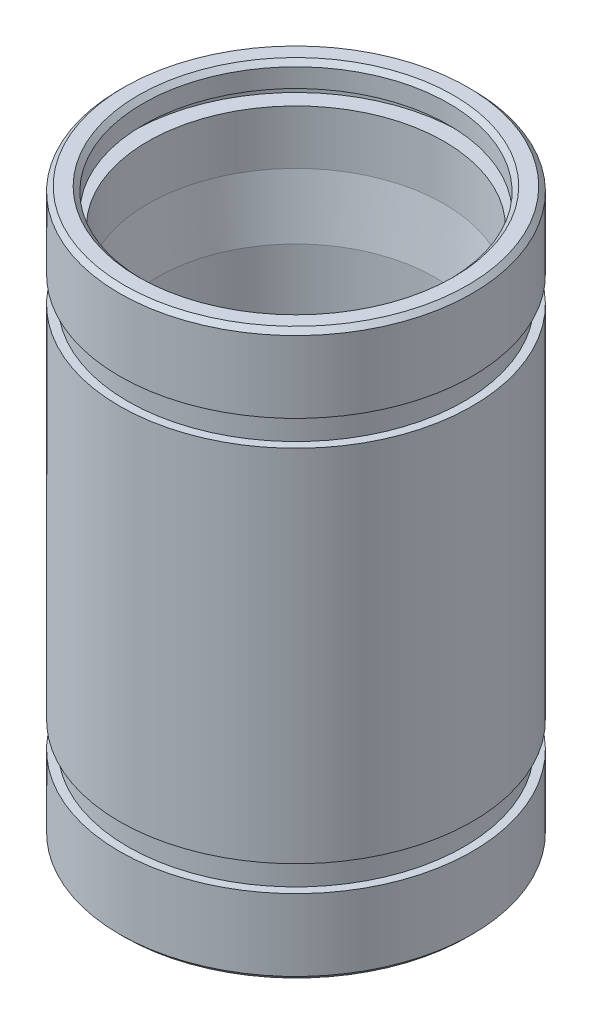
ISO-10303-21;
HEADER;
FILE_DESCRIPTION(('STEP AP214'),'2;1');
FILE_NAME('part.step','',(''),(''),'','','');
FILE_SCHEMA(('AUTOMOTIVE_DESIGN { 1 0 10303 214 1 1 1 1 }'));
ENDSEC;
DATA;
#1=APPLICATION_CONTEXT('core data for automotive mechanical design processes');
#2=APPLICATION_PROTOCOL_DEFINITION('international standard','automotive_design',2000,#1);
#3=PRODUCT_CONTEXT('',#1,'mechanical');
#4=PRODUCT('Part','Part','',(#3));
#5=PRODUCT_RELATED_PRODUCT_CATEGORY('part','',(#4));
#6=PRODUCT_DEFINITION_FORMATION('','',#4);
#7=PRODUCT_DEFINITION_CONTEXT('part definition',#1,'design');
#8=PRODUCT_DEFINITION('design','',#6,#7);
#9=PRODUCT_DEFINITION_SHAPE('','',#8);
#10=(LENGTH_UNIT() NAMED_UNIT(*) SI_UNIT(.MILLI.,.METRE.));
#11=(NAMED_UNIT(*) PLANE_ANGLE_UNIT() SI_UNIT($,.RADIAN.));
#12=(NAMED_UNIT(*) SI_UNIT($,.STERADIAN.) SOLID_ANGLE_UNIT());
#13=UNCERTAINTY_MEASURE_WITH_UNIT(LENGTH_MEASURE(1.E-05),#10,'distance_accuracy_value','');
#14=(GEOMETRIC_REPRESENTATION_CONTEXT(3) GLOBAL_UNCERTAINTY_ASSIGNED_CONTEXT((#13)) GLOBAL_UNIT_ASSIGNED_CONTEXT((#10,
#11,#12)) REPRESENTATION_CONTEXT('',''));
#15=CARTESIAN_POINT('',(0.,0.,0.));
#16=DIRECTION('',(0.,0.,1.));
#17=DIRECTION('',(1.,0.,0.));
#18=AXIS2_PLACEMENT_3D('',#15,#16,#17);
#19=CARTESIAN_POINT('',(0.,10.5,-7.));
#20=DIRECTION('',(0.,-1.,0.));
#21=DIRECTION('',(0.,0.,-1.));
#22=AXIS2_PLACEMENT_3D('',#19,#20,#21);
#23=PLANE('',#22);
#24=CARTESIAN_POINT('',(0.,10.5,0.));
#25=DIRECTION('',(0.,1.,0.));
#26=DIRECTION('',(0.,0.,1.));
#27=AXIS2_PLACEMENT_3D('',#24,#25,#26);
#28=CIRCLE('',#27,6.3);
#29=CARTESIAN_POINT('',(0.,10.5,6.30000000000001));
#30=VERTEX_POINT('',#29);
#31=EDGE_CURVE('E10',#30,#30,#28,.T.);
#32=ORIENTED_EDGE('',*,*,#31,.F.);
#33=EDGE_LOOP('',(#32));
#34=FACE_BOUND('',#33,.T.);
#35=CARTESIAN_POINT('',(0.,10.5,0.));
#36=DIRECTION('',(0.,1.,0.));
#37=DIRECTION('',(0.,0.,1.));
#38=AXIS2_PLACEMENT_3D('',#35,#36,#37);
#39=CIRCLE('',#38,7.);
#40=CARTESIAN_POINT('',(0.,10.5,7.00000000000001));
#41=VERTEX_POINT('',#40);
#42=EDGE_CURVE('E122',#41,#41,#39,.T.);
#43=ORIENTED_EDGE('',*,*,#42,.T.);
#44=EDGE_LOOP('',(#43));
#45=FACE_BOUND('',#44,.T.);
#46=ADVANCED_FACE('F34',(#34,#45),#23,.F.);
#47=CARTESIAN_POINT('',(0.,12.,0.));
#48=DIRECTION('',(0.,1.,0.));
#49=DIRECTION('',(0.,0.,1.));
#50=AXIS2_PLACEMENT_3D('',#47,#48,#49);
#51=CYLINDRICAL_SURFACE('',#50,6.3);
#52=CARTESIAN_POINT('',(0.,8.2,0.));
#53=DIRECTION('',(0.,1.,0.));
#54=DIRECTION('',(0.,0.,1.));
#55=AXIS2_PLACEMENT_3D('',#52,#53,#54);
#56=CIRCLE('',#55,6.3);
#57=CARTESIAN_POINT('',(0.,8.2,6.30000000000001));
#58=VERTEX_POINT('',#57);
#59=EDGE_CURVE('E40',#58,#58,#56,.T.);
#60=ORIENTED_EDGE('',*,*,#59,.F.);
#61=EDGE_LOOP('',(#60));
#62=FACE_BOUND('',#61,.T.);
#63=ORIENTED_EDGE('',*,*,#31,.T.);
#64=EDGE_LOOP('',(#63));
#65=FACE_BOUND('',#64,.T.);
#66=ADVANCED_FACE('F279',(#62,#65),#51,.F.);
#67=CARTESIAN_POINT('',(0.,8.2,0.));
#68=DIRECTION('',(0.,1.,0.));
#69=DIRECTION('',(0.,0.,1.));
#70=AXIS2_PLACEMENT_3D('',#67,#68,#69);
#71=CONICAL_SURFACE('',#70,6.3,0.158655262186401);
#72=CARTESIAN_POINT('',(0.,5.7,0.));
#73=DIRECTION('',(0.,1.,0.));
#74=DIRECTION('',(0.,0.,1.));
#75=AXIS2_PLACEMENT_3D('',#72,#73,#74);
#76=CIRCLE('',#75,5.9);
#77=CARTESIAN_POINT('',(0.,5.7,5.90000000000001));
#78=VERTEX_POINT('',#77);
#79=EDGE_CURVE('E44',#78,#78,#76,.T.);
#80=ORIENTED_EDGE('',*,*,#79,.F.);
#81=EDGE_LOOP('',(#80));
#82=FACE_BOUND('',#81,.T.);
#83=ORIENTED_EDGE('',*,*,#59,.T.);
#84=EDGE_LOOP('',(#83));
#85=FACE_BOUND('',#84,.T.);
#86=ADVANCED_FACE('F274',(#82,#85),#71,.F.);
#87=CARTESIAN_POINT('',(0.,12.,0.));
#88=DIRECTION('',(0.,1.,0.));
#89=DIRECTION('',(0.,0.,1.));
#90=AXIS2_PLACEMENT_3D('',#87,#88,#89);
#91=CYLINDRICAL_SURFACE('',#90,5.9);
#92=CARTESIAN_POINT('',(0.,-5.7,0.));
#93=DIRECTION('',(0.,1.,0.));
#94=DIRECTION('',(0.,0.,1.));
#95=AXIS2_PLACEMENT_3D('',#92,#93,#94);
#96=CIRCLE('',#95,5.9);
#97=CARTESIAN_POINT('',(0.,-5.70000000000001,5.9));
#98=VERTEX_POINT('',#97);
#99=EDGE_CURVE('E48',#98,#98,#96,.T.);
#100=ORIENTED_EDGE('',*,*,#99,.F.);
#101=EDGE_LOOP('',(#100));
#102=FACE_BOUND('',#101,.T.);
#103=ORIENTED_EDGE('',*,*,#79,.T.);
#104=EDGE_LOOP('',(#103));
#105=FACE_BOUND('',#104,.T.);
#106=ADVANCED_FACE('F268',(#102,#105),#91,.F.);
#107=CARTESIAN_POINT('',(0.,-5.7,0.));
#108=DIRECTION('',(0.,-1.,0.));
#109=DIRECTION('',(0.,0.,-1.));
#110=AXIS2_PLACEMENT_3D('',#107,#108,#109);
#111=CONICAL_SURFACE('',#110,5.9,0.158655262186401);
#112=CARTESIAN_POINT('',(0.,-8.20000000000001,0.));
#113=DIRECTION('',(0.,1.,0.));
#114=DIRECTION('',(0.,0.,1.));
#115=AXIS2_PLACEMENT_3D('',#112,#113,#114);
#116=CIRCLE('',#115,6.3);
#117=CARTESIAN_POINT('',(0.,-8.20000000000001,6.3));
#118=VERTEX_POINT('',#117);
#119=EDGE_CURVE('E53',#118,#118,#116,.T.);
#120=ORIENTED_EDGE('',*,*,#119,.F.);
#121=EDGE_LOOP('',(#120));
#122=FACE_BOUND('',#121,.T.);
#123=ORIENTED_EDGE('',*,*,#99,.T.);
#124=EDGE_LOOP('',(#123));
#125=FACE_BOUND('',#124,.T.);
#126=ADVANCED_FACE('F262',(#122,#125),#111,.F.);
#127=CARTESIAN_POINT('',(0.,12.,0.));
#128=DIRECTION('',(0.,1.,0.));
#129=DIRECTION('',(0.,0.,1.));
#130=AXIS2_PLACEMENT_3D('',#127,#128,#129);
#131=CYLINDRICAL_SURFACE('',#130,6.3);
#132=CARTESIAN_POINT('',(0.,-10.5,0.));
#133=DIRECTION('',(0.,1.,0.));
#134=DIRECTION('',(0.,0.,1.));
#135=AXIS2_PLACEMENT_3D('',#132,#133,#134);
#136=CIRCLE('',#135,6.3);
#137=CARTESIAN_POINT('',(0.,-10.5,6.29999999999999));
#138=VERTEX_POINT('',#137);
#139=EDGE_CURVE('E56',#138,#138,#136,.T.);
#140=ORIENTED_EDGE('',*,*,#139,.F.);
#141=EDGE_LOOP('',(#140));
#142=FACE_BOUND('',#141,.T.);
#143=ORIENTED_EDGE('',*,*,#119,.T.);
#144=EDGE_LOOP('',(#143));
#145=FACE_BOUND('',#144,.T.);
#146=ADVANCED_FACE('F256',(#142,#145),#131,.F.);
#147=CARTESIAN_POINT('',(0.,-10.5,-7.));
#148=DIRECTION('',(0.,1.,0.));
#149=DIRECTION('',(0.,0.,1.));
#150=AXIS2_PLACEMENT_3D('',#147,#148,#149);
#151=PLANE('',#150);
#152=CARTESIAN_POINT('',(0.,-10.5,0.));
#153=DIRECTION('',(0.,1.,0.));
#154=DIRECTION('',(0.,0.,1.));
#155=AXIS2_PLACEMENT_3D('',#152,#153,#154);
#156=CIRCLE('',#155,7.);
#157=CARTESIAN_POINT('',(0.,-10.5,6.99999999999999));
#158=VERTEX_POINT('',#157);
#159=EDGE_CURVE('E59',#158,#158,#156,.T.);
#160=ORIENTED_EDGE('',*,*,#159,.F.);
#161=EDGE_LOOP('',(#160));
#162=FACE_BOUND('',#161,.T.);
#163=ORIENTED_EDGE('',*,*,#139,.T.);
#164=EDGE_LOOP('',(#163));
#165=FACE_BOUND('',#164,.T.);
#166=ADVANCED_FACE('F250',(#162,#165),#151,.F.);
#167=CARTESIAN_POINT('',(0.,12.,0.));
#168=DIRECTION('',(0.,1.,0.));
#169=DIRECTION('',(0.,0.,1.));
#170=AXIS2_PLACEMENT_3D('',#167,#168,#169);
#171=CYLINDRICAL_SURFACE('',#170,7.);
#172=CARTESIAN_POINT('',(0.,-11.,0.));
#173=DIRECTION('',(0.,1.,0.));
#174=DIRECTION('',(0.,0.,1.));
#175=AXIS2_PLACEMENT_3D('',#172,#173,#174);
#176=CIRCLE('',#175,7.);
#177=CARTESIAN_POINT('',(0.,-11.,6.99999999999999));
#178=VERTEX_POINT('',#177);
#179=EDGE_CURVE('E62',#178,#178,#176,.T.);
#180=ORIENTED_EDGE('',*,*,#179,.F.);
#181=EDGE_LOOP('',(#180));
#182=FACE_BOUND('',#181,.T.);
#183=ORIENTED_EDGE('',*,*,#159,.T.);
#184=EDGE_LOOP('',(#183));
#185=FACE_BOUND('',#184,.T.);
#186=ADVANCED_FACE('F244',(#182,#185),#171,.F.);
#187=CARTESIAN_POINT('',(0.,-11.,-6.5));
#188=DIRECTION('',(0.,-1.,0.));
#189=DIRECTION('',(0.,0.,-1.));
#190=AXIS2_PLACEMENT_3D('',#187,#188,#189);
#191=PLANE('',#190);
#192=CARTESIAN_POINT('',(0.,-11.,0.));
#193=DIRECTION('',(0.,1.,0.));
#194=DIRECTION('',(0.,0.,1.));
#195=AXIS2_PLACEMENT_3D('',#192,#193,#194);
#196=CIRCLE('',#195,6.49999999999999);
#197=CARTESIAN_POINT('',(0.,-11.,6.49999999999999));
#198=VERTEX_POINT('',#197);
#199=EDGE_CURVE('E65',#198,#198,#196,.T.);
#200=ORIENTED_EDGE('',*,*,#199,.F.);
#201=EDGE_LOOP('',(#200));
#202=FACE_BOUND('',#201,.T.);
#203=ORIENTED_EDGE('',*,*,#179,.T.);
#204=EDGE_LOOP('',(#203));
#205=FACE_BOUND('',#204,.T.);
#206=ADVANCED_FACE('F238',(#202,#205),#191,.F.);
#207=CARTESIAN_POINT('',(0.,12.,0.));
#208=DIRECTION('',(0.,1.,0.));
#209=DIRECTION('',(0.,0.,1.));
#210=AXIS2_PLACEMENT_3D('',#207,#208,#209);
#211=CYLINDRICAL_SURFACE('',#210,6.49999999999999);
#212=CARTESIAN_POINT('',(0.,-11.8,0.));
#213=DIRECTION('',(0.,1.,0.));
#214=DIRECTION('',(0.,0.,1.));
#215=AXIS2_PLACEMENT_3D('',#212,#213,#214);
#216=CIRCLE('',#215,6.49999999999999);
#217=CARTESIAN_POINT('',(0.,-11.8,6.49999999999999));
#218=VERTEX_POINT('',#217);
#219=EDGE_CURVE('E68',#218,#218,#216,.T.);
#220=ORIENTED_EDGE('',*,*,#219,.F.);
#221=EDGE_LOOP('',(#220));
#222=FACE_BOUND('',#221,.T.);
#223=ORIENTED_EDGE('',*,*,#199,.T.);
#224=EDGE_LOOP('',(#223));
#225=FACE_BOUND('',#224,.T.);
#226=ADVANCED_FACE('F232',(#222,#225),#211,.F.);
#227=CARTESIAN_POINT('',(0.,-11.8,0.));
#228=DIRECTION('',(0.,-1.,0.));
#229=DIRECTION('',(0.,0.,-1.));
#230=AXIS2_PLACEMENT_3D('',#227,#228,#229);
#231=CONICAL_SURFACE('',#230,6.49999999999999,0.785398163397444);
#232=CARTESIAN_POINT('',(0.,-12.,0.));
#233=DIRECTION('',(0.,1.,0.));
#234=DIRECTION('',(0.,0.,1.));
#235=AXIS2_PLACEMENT_3D('',#232,#233,#234);
#236=CIRCLE('',#235,6.69999999999999);
#237=CARTESIAN_POINT('',(0.,-12.,6.69999999999999));
#238=VERTEX_POINT('',#237);
#239=EDGE_CURVE('E71',#238,#238,#236,.T.);
#240=ORIENTED_EDGE('',*,*,#239,.F.);
#241=EDGE_LOOP('',(#240));
#242=FACE_BOUND('',#241,.T.);
#243=ORIENTED_EDGE('',*,*,#219,.T.);
#244=EDGE_LOOP('',(#243));
#245=FACE_BOUND('',#244,.T.);
#246=ADVANCED_FACE('F226',(#242,#245),#231,.F.);
#247=CARTESIAN_POINT('',(0.,-12.,-6.7));
#248=DIRECTION('',(0.,1.,0.));
#249=DIRECTION('',(0.,0.,1.));
#250=AXIS2_PLACEMENT_3D('',#247,#248,#249);
#251=PLANE('',#250);
#252=CARTESIAN_POINT('',(0.,-12.,0.));
#253=DIRECTION('',(0.,1.,0.));
#254=DIRECTION('',(0.,0.,1.));
#255=AXIS2_PLACEMENT_3D('',#252,#253,#254);
#256=CIRCLE('',#255,7.29999999999999);
#257=CARTESIAN_POINT('',(0.,-12.,7.29999999999999));
#258=VERTEX_POINT('',#257);
#259=EDGE_CURVE('E74',#258,#258,#256,.T.);
#260=ORIENTED_EDGE('',*,*,#259,.F.);
#261=EDGE_LOOP('',(#260));
#262=FACE_BOUND('',#261,.T.);
#263=ORIENTED_EDGE('',*,*,#239,.T.);
#264=EDGE_LOOP('',(#263));
#265=FACE_BOUND('',#264,.T.);
#266=ADVANCED_FACE('F220',(#262,#265),#251,.F.);
#267=CARTESIAN_POINT('',(0.,-12.,0.));
#268=DIRECTION('',(0.,1.,0.));
#269=DIRECTION('',(0.,0.,1.));
#270=AXIS2_PLACEMENT_3D('',#267,#268,#269);
#271=CONICAL_SURFACE('',#270,7.29999999999999,0.785398163397455);
#272=CARTESIAN_POINT('',(0.,-11.8,0.));
#273=DIRECTION('',(0.,1.,0.));
#274=DIRECTION('',(0.,0.,1.));
#275=AXIS2_PLACEMENT_3D('',#272,#273,#274);
#276=CIRCLE('',#275,7.49999999999999);
#277=CARTESIAN_POINT('',(0.,-11.8,7.49999999999999));
#278=VERTEX_POINT('',#277);
#279=EDGE_CURVE('E77',#278,#278,#276,.T.);
#280=ORIENTED_EDGE('',*,*,#279,.F.);
#281=EDGE_LOOP('',(#280));
#282=FACE_BOUND('',#281,.T.);
#283=ORIENTED_EDGE('',*,*,#259,.T.);
#284=EDGE_LOOP('',(#283));
#285=FACE_BOUND('',#284,.T.);
#286=ADVANCED_FACE('F214',(#282,#285),#271,.T.);
#287=CARTESIAN_POINT('',(0.,12.,0.));
#288=DIRECTION('',(0.,1.,0.));
#289=DIRECTION('',(0.,0.,1.));
#290=AXIS2_PLACEMENT_3D('',#287,#288,#289);
#291=CYLINDRICAL_SURFACE('',#290,7.49999999999999);
#292=CARTESIAN_POINT('',(0.,-8.75,0.));
#293=DIRECTION('',(0.,1.,0.));
#294=DIRECTION('',(0.,0.,1.));
#295=AXIS2_PLACEMENT_3D('',#292,#293,#294);
#296=CIRCLE('',#295,7.5);
#297=CARTESIAN_POINT('',(0.,-8.75000000000001,7.49999999999999));
#298=VERTEX_POINT('',#297);
#299=EDGE_CURVE('E80',#298,#298,#296,.T.);
#300=ORIENTED_EDGE('',*,*,#299,.F.);
#301=EDGE_LOOP('',(#300));
#302=FACE_BOUND('',#301,.T.);
#303=ORIENTED_EDGE('',*,*,#279,.T.);
#304=EDGE_LOOP('',(#303));
#305=FACE_BOUND('',#304,.T.);
#306=ADVANCED_FACE('F208',(#302,#305),#291,.T.);
#307=CARTESIAN_POINT('',(0.,-8.75,-7.5));
#308=DIRECTION('',(0.,-1.,0.));
#309=DIRECTION('',(0.,0.,-1.));
#310=AXIS2_PLACEMENT_3D('',#307,#308,#309);
#311=PLANE('',#310);
#312=CARTESIAN_POINT('',(0.,-8.75,0.));
#313=DIRECTION('',(0.,1.,0.));
#314=DIRECTION('',(0.,0.,1.));
#315=AXIS2_PLACEMENT_3D('',#312,#313,#314);
#316=CIRCLE('',#315,7.15);
#317=CARTESIAN_POINT('',(0.,-8.75000000000001,7.15));
#318=VERTEX_POINT('',#317);
#319=EDGE_CURVE('E83',#318,#318,#316,.T.);
#320=ORIENTED_EDGE('',*,*,#319,.F.);
#321=EDGE_LOOP('',(#320));
#322=FACE_BOUND('',#321,.T.);
#323=ORIENTED_EDGE('',*,*,#299,.T.);
#324=EDGE_LOOP('',(#323));
#325=FACE_BOUND('',#324,.T.);
#326=ADVANCED_FACE('F202',(#322,#325),#311,.F.);
#327=CARTESIAN_POINT('',(0.,12.,0.));
#328=DIRECTION('',(0.,1.,0.));
#329=DIRECTION('',(0.,0.,1.));
#330=AXIS2_PLACEMENT_3D('',#327,#328,#329);
#331=CYLINDRICAL_SURFACE('',#330,7.15);
#332=CARTESIAN_POINT('',(0.,-7.65,0.));
#333=DIRECTION('',(0.,1.,0.));
#334=DIRECTION('',(0.,0.,1.));
#335=AXIS2_PLACEMENT_3D('',#332,#333,#334);
#336=CIRCLE('',#335,7.15);
#337=CARTESIAN_POINT('',(0.,-7.65000000000001,7.15));
#338=VERTEX_POINT('',#337);
#339=EDGE_CURVE('E86',#338,#338,#336,.T.);
#340=ORIENTED_EDGE('',*,*,#339,.F.);
#341=EDGE_LOOP('',(#340));
#342=FACE_BOUND('',#341,.T.);
#343=ORIENTED_EDGE('',*,*,#319,.T.);
#344=EDGE_LOOP('',(#343));
#345=FACE_BOUND('',#344,.T.);
#346=ADVANCED_FACE('F196',(#342,#345),#331,.T.);
#347=CARTESIAN_POINT('',(0.,-7.65,-7.15));
#348=DIRECTION('',(0.,1.,0.));
#349=DIRECTION('',(0.,0.,1.));
#350=AXIS2_PLACEMENT_3D('',#347,#348,#349);
#351=PLANE('',#350);
#352=CARTESIAN_POINT('',(0.,-7.65,0.));
#353=DIRECTION('',(0.,1.,0.));
#354=DIRECTION('',(0.,0.,1.));
#355=AXIS2_PLACEMENT_3D('',#352,#353,#354);
#356=CIRCLE('',#355,7.5);
#357=CARTESIAN_POINT('',(0.,-7.65000000000001,7.5));
#358=VERTEX_POINT('',#357);
#359=EDGE_CURVE('E89',#358,#358,#356,.T.);
#360=ORIENTED_EDGE('',*,*,#359,.F.);
#361=EDGE_LOOP('',(#360));
#362=FACE_BOUND('',#361,.T.);
#363=ORIENTED_EDGE('',*,*,#339,.T.);
#364=EDGE_LOOP('',(#363));
#365=FACE_BOUND('',#364,.T.);
#366=ADVANCED_FACE('F190',(#362,#365),#351,.F.);
#367=CARTESIAN_POINT('',(0.,12.,0.));
#368=DIRECTION('',(0.,1.,0.));
#369=DIRECTION('',(0.,0.,1.));
#370=AXIS2_PLACEMENT_3D('',#367,#368,#369);
#371=CYLINDRICAL_SURFACE('',#370,7.5);
#372=CARTESIAN_POINT('',(0.,7.65,0.));
#373=DIRECTION('',(0.,1.,0.));
#374=DIRECTION('',(0.,0.,1.));
#375=AXIS2_PLACEMENT_3D('',#372,#373,#374);
#376=CIRCLE('',#375,7.5);
#377=CARTESIAN_POINT('',(0.,7.65,7.50000000000001));
#378=VERTEX_POINT('',#377);
#379=EDGE_CURVE('E92',#378,#378,#376,.T.);
#380=ORIENTED_EDGE('',*,*,#379,.F.);
#381=EDGE_LOOP('',(#380));
#382=FACE_BOUND('',#381,.T.);
#383=ORIENTED_EDGE('',*,*,#359,.T.);
#384=EDGE_LOOP('',(#383));
#385=FACE_BOUND('',#384,.T.);
#386=ADVANCED_FACE('F184',(#382,#385),#371,.T.);
#387=CARTESIAN_POINT('',(0.,7.65,-7.15));
#388=DIRECTION('',(0.,-1.,0.));
#389=DIRECTION('',(0.,0.,-1.));
#390=AXIS2_PLACEMENT_3D('',#387,#388,#389);
#391=PLANE('',#390);
#392=CARTESIAN_POINT('',(0.,7.65,0.));
#393=DIRECTION('',(0.,1.,0.));
#394=DIRECTION('',(0.,0.,1.));
#395=AXIS2_PLACEMENT_3D('',#392,#393,#394);
#396=CIRCLE('',#395,7.15);
#397=CARTESIAN_POINT('',(0.,7.65,7.15000000000001));
#398=VERTEX_POINT('',#397);
#399=EDGE_CURVE('E95',#398,#398,#396,.T.);
#400=ORIENTED_EDGE('',*,*,#399,.F.);
#401=EDGE_LOOP('',(#400));
#402=FACE_BOUND('',#401,.T.);
#403=ORIENTED_EDGE('',*,*,#379,.T.);
#404=EDGE_LOOP('',(#403));
#405=FACE_BOUND('',#404,.T.);
#406=ADVANCED_FACE('F178',(#402,#405),#391,.F.);
#407=CARTESIAN_POINT('',(0.,12.,0.));
#408=DIRECTION('',(0.,1.,0.));
#409=DIRECTION('',(0.,0.,1.));
#410=AXIS2_PLACEMENT_3D('',#407,#408,#409);
#411=CYLINDRICAL_SURFACE('',#410,7.15);
#412=CARTESIAN_POINT('',(0.,8.75,0.));
#413=DIRECTION('',(0.,1.,0.));
#414=DIRECTION('',(0.,0.,1.));
#415=AXIS2_PLACEMENT_3D('',#412,#413,#414);
#416=CIRCLE('',#415,7.15);
#417=CARTESIAN_POINT('',(0.,8.75,7.15000000000001));
#418=VERTEX_POINT('',#417);
#419=EDGE_CURVE('E98',#418,#418,#416,.T.);
#420=ORIENTED_EDGE('',*,*,#419,.F.);
#421=EDGE_LOOP('',(#420));
#422=FACE_BOUND('',#421,.T.);
#423=ORIENTED_EDGE('',*,*,#399,.T.);
#424=EDGE_LOOP('',(#423));
#425=FACE_BOUND('',#424,.T.);
#426=ADVANCED_FACE('F172',(#422,#425),#411,.T.);
#427=CARTESIAN_POINT('',(0.,8.75,-7.5));
#428=DIRECTION('',(0.,1.,0.));
#429=DIRECTION('',(0.,0.,1.));
#430=AXIS2_PLACEMENT_3D('',#427,#428,#429);
#431=PLANE('',#430);
#432=CARTESIAN_POINT('',(0.,8.75,0.));
#433=DIRECTION('',(0.,1.,0.));
#434=DIRECTION('',(0.,0.,1.));
#435=AXIS2_PLACEMENT_3D('',#432,#433,#434);
#436=CIRCLE('',#435,7.5);
#437=CARTESIAN_POINT('',(0.,8.75,7.50000000000001));
#438=VERTEX_POINT('',#437);
#439=EDGE_CURVE('E101',#438,#438,#436,.T.);
#440=ORIENTED_EDGE('',*,*,#439,.F.);
#441=EDGE_LOOP('',(#440));
#442=FACE_BOUND('',#441,.T.);
#443=ORIENTED_EDGE('',*,*,#419,.T.);
#444=EDGE_LOOP('',(#443));
#445=FACE_BOUND('',#444,.T.);
#446=ADVANCED_FACE('F166',(#442,#445),#431,.F.);
#447=CARTESIAN_POINT('',(0.,12.,0.));
#448=DIRECTION('',(0.,1.,0.));
#449=DIRECTION('',(0.,0.,1.));
#450=AXIS2_PLACEMENT_3D('',#447,#448,#449);
#451=CYLINDRICAL_SURFACE('',#450,7.5);
#452=CARTESIAN_POINT('',(0.,11.8,0.));
#453=DIRECTION('',(0.,1.,0.));
#454=DIRECTION('',(0.,0.,1.));
#455=AXIS2_PLACEMENT_3D('',#452,#453,#454);
#456=CIRCLE('',#455,7.5);
#457=CARTESIAN_POINT('',(0.,11.8,7.50000000000001));
#458=VERTEX_POINT('',#457);
#459=EDGE_CURVE('E104',#458,#458,#456,.T.);
#460=ORIENTED_EDGE('',*,*,#459,.F.);
#461=EDGE_LOOP('',(#460));
#462=FACE_BOUND('',#461,.T.);
#463=ORIENTED_EDGE('',*,*,#439,.T.);
#464=EDGE_LOOP('',(#463));
#465=FACE_BOUND('',#464,.T.);
#466=ADVANCED_FACE('F160',(#462,#465),#451,.T.);
#467=CARTESIAN_POINT('',(0.,11.8,0.));
#468=DIRECTION('',(0.,-1.,0.));
#469=DIRECTION('',(0.,0.,-1.));
#470=AXIS2_PLACEMENT_3D('',#467,#468,#469);
#471=CONICAL_SURFACE('',#470,7.5,0.785398163397455);
#472=CARTESIAN_POINT('',(0.,12.,0.));
#473=DIRECTION('',(0.,1.,0.));
#474=DIRECTION('',(0.,0.,1.));
#475=AXIS2_PLACEMENT_3D('',#472,#473,#474);
#476=CIRCLE('',#475,7.3);
#477=CARTESIAN_POINT('',(0.,12.,7.3));
#478=VERTEX_POINT('',#477);
#479=EDGE_CURVE('E107',#478,#478,#476,.T.);
#480=ORIENTED_EDGE('',*,*,#479,.F.);
#481=EDGE_LOOP('',(#480));
#482=FACE_BOUND('',#481,.T.);
#483=ORIENTED_EDGE('',*,*,#459,.T.);
#484=EDGE_LOOP('',(#483));
#485=FACE_BOUND('',#484,.T.);
#486=ADVANCED_FACE('F154',(#482,#485),#471,.T.);
#487=CARTESIAN_POINT('',(0.,12.,-6.7));
#488=DIRECTION('',(0.,-1.,0.));
#489=DIRECTION('',(0.,0.,-1.));
#490=AXIS2_PLACEMENT_3D('',#487,#488,#489);
#491=PLANE('',#490);
#492=CARTESIAN_POINT('',(0.,12.,0.));
#493=DIRECTION('',(0.,1.,0.));
#494=DIRECTION('',(0.,0.,1.));
#495=AXIS2_PLACEMENT_3D('',#492,#493,#494);
#496=CIRCLE('',#495,6.7);
#497=CARTESIAN_POINT('',(0.,12.,6.70000000000001));
#498=VERTEX_POINT('',#497);
#499=EDGE_CURVE('E110',#498,#498,#496,.T.);
#500=ORIENTED_EDGE('',*,*,#499,.F.);
#501=EDGE_LOOP('',(#500));
#502=FACE_BOUND('',#501,.T.);
#503=ORIENTED_EDGE('',*,*,#479,.T.);
#504=EDGE_LOOP('',(#503));
#505=FACE_BOUND('',#504,.T.);
#506=ADVANCED_FACE('F148',(#502,#505),#491,.F.);
#507=CARTESIAN_POINT('',(0.,12.,0.));
#508=DIRECTION('',(0.,1.,0.));
#509=DIRECTION('',(0.,0.,1.));
#510=AXIS2_PLACEMENT_3D('',#507,#508,#509);
#511=CONICAL_SURFACE('',#510,6.7,0.785398163397444);
#512=CARTESIAN_POINT('',(0.,11.8,0.));
#513=DIRECTION('',(0.,1.,0.));
#514=DIRECTION('',(0.,0.,1.));
#515=AXIS2_PLACEMENT_3D('',#512,#513,#514);
#516=CIRCLE('',#515,6.5);
#517=CARTESIAN_POINT('',(0.,11.8,6.50000000000001));
#518=VERTEX_POINT('',#517);
#519=EDGE_CURVE('E113',#518,#518,#516,.T.);
#520=ORIENTED_EDGE('',*,*,#519,.F.);
#521=EDGE_LOOP('',(#520));
#522=FACE_BOUND('',#521,.T.);
#523=ORIENTED_EDGE('',*,*,#499,.T.);
#524=EDGE_LOOP('',(#523));
#525=FACE_BOUND('',#524,.T.);
#526=ADVANCED_FACE('F142',(#522,#525),#511,.F.);
#527=CARTESIAN_POINT('',(0.,12.,0.));
#528=DIRECTION('',(0.,1.,0.));
#529=DIRECTION('',(0.,0.,1.));
#530=AXIS2_PLACEMENT_3D('',#527,#528,#529);
#531=CYLINDRICAL_SURFACE('',#530,6.5);
#532=CARTESIAN_POINT('',(0.,11.,0.));
#533=DIRECTION('',(0.,1.,0.));
#534=DIRECTION('',(0.,0.,1.));
#535=AXIS2_PLACEMENT_3D('',#532,#533,#534);
#536=CIRCLE('',#535,6.5);
#537=CARTESIAN_POINT('',(0.,11.,6.50000000000001));
#538=VERTEX_POINT('',#537);
#539=EDGE_CURVE('E116',#538,#538,#536,.T.);
#540=ORIENTED_EDGE('',*,*,#539,.F.);
#541=EDGE_LOOP('',(#540));
#542=FACE_BOUND('',#541,.T.);
#543=ORIENTED_EDGE('',*,*,#519,.T.);
#544=EDGE_LOOP('',(#543));
#545=FACE_BOUND('',#544,.T.);
#546=ADVANCED_FACE('F136',(#542,#545),#531,.F.);
#547=CARTESIAN_POINT('',(0.,11.,-6.5));
#548=DIRECTION('',(0.,1.,0.));
#549=DIRECTION('',(0.,0.,1.));
#550=AXIS2_PLACEMENT_3D('',#547,#548,#549);
#551=PLANE('',#550);
#552=CARTESIAN_POINT('',(0.,11.,0.));
#553=DIRECTION('',(0.,1.,0.));
#554=DIRECTION('',(0.,0.,1.));
#555=AXIS2_PLACEMENT_3D('',#552,#553,#554);
#556=CIRCLE('',#555,7.);
#557=CARTESIAN_POINT('',(0.,11.,7.00000000000001));
#558=VERTEX_POINT('',#557);
#559=EDGE_CURVE('E119',#558,#558,#556,.T.);
#560=ORIENTED_EDGE('',*,*,#559,.F.);
#561=EDGE_LOOP('',(#560));
#562=FACE_BOUND('',#561,.T.);
#563=ORIENTED_EDGE('',*,*,#539,.T.);
#564=EDGE_LOOP('',(#563));
#565=FACE_BOUND('',#564,.T.);
#566=ADVANCED_FACE('F130',(#562,#565),#551,.F.);
#567=CARTESIAN_POINT('',(0.,12.,0.));
#568=DIRECTION('',(0.,1.,0.));
#569=DIRECTION('',(0.,0.,1.));
#570=AXIS2_PLACEMENT_3D('',#567,#568,#569);
#571=CYLINDRICAL_SURFACE('',#570,7.);
#572=ORIENTED_EDGE('',*,*,#42,.F.);
#573=EDGE_LOOP('',(#572));
#574=FACE_BOUND('',#573,.T.);
#575=ORIENTED_EDGE('',*,*,#559,.T.);
#576=EDGE_LOOP('',(#575));
#577=FACE_BOUND('',#576,.T.);
#578=ADVANCED_FACE('F127',(#574,#577),#571,.F.);
#579=CLOSED_SHELL('',(#46,#66,#86,#106,#126,#146,#166,#186,#206,#226,#246,#266,#286,#306,#326,
#346,#366,#386,#406,#426,#446,#466,#486,#506,#526,#546,#566,#578));
#580=MANIFOLD_SOLID_BREP('B2',#579);
#581=ADVANCED_BREP_SHAPE_REPRESENTATION('',(#18,#580),#14);
#582=SHAPE_DEFINITION_REPRESENTATION(#9,#581);
ENDSEC;
END-ISO-10303-21;
